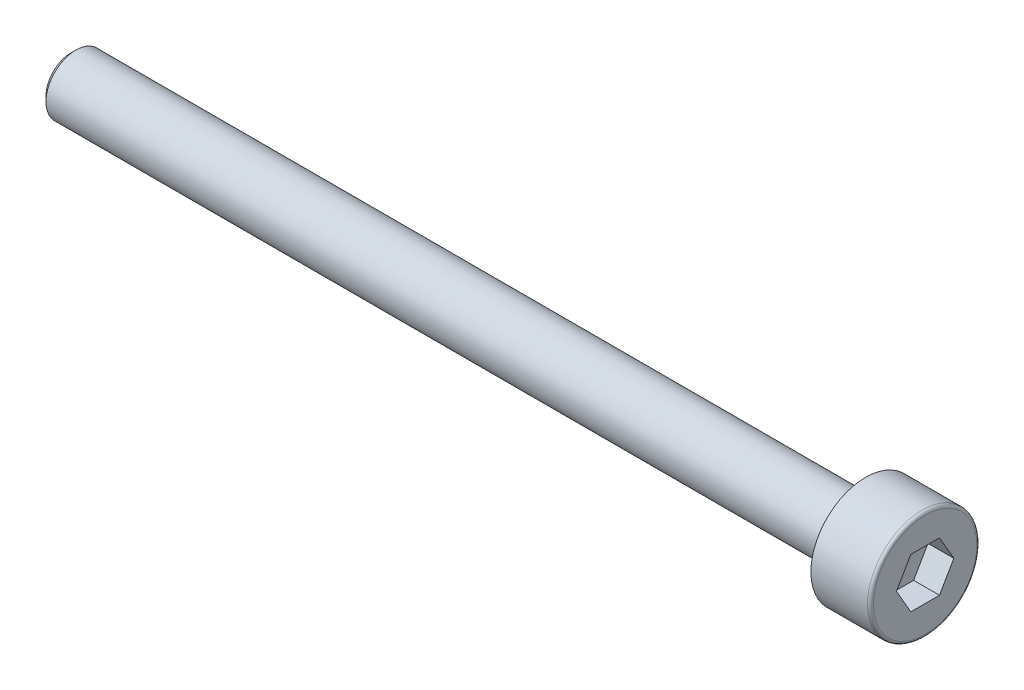
ISO-10303-21;
HEADER;
FILE_DESCRIPTION(('STEP AP214'),'2;1');
FILE_NAME('part.step','',(''),(''),'','','');
FILE_SCHEMA(('AUTOMOTIVE_DESIGN { 1 0 10303 214 1 1 1 1 }'));
ENDSEC;
DATA;
#1=APPLICATION_CONTEXT('core data for automotive mechanical design processes');
#2=APPLICATION_PROTOCOL_DEFINITION('international standard','automotive_design',2000,#1);
#3=PRODUCT_CONTEXT('',#1,'mechanical');
#4=PRODUCT('Part','Part','',(#3));
#5=PRODUCT_RELATED_PRODUCT_CATEGORY('part','',(#4));
#6=PRODUCT_DEFINITION_FORMATION('','',#4);
#7=PRODUCT_DEFINITION_CONTEXT('part definition',#1,'design');
#8=PRODUCT_DEFINITION('design','',#6,#7);
#9=PRODUCT_DEFINITION_SHAPE('','',#8);
#10=(LENGTH_UNIT() NAMED_UNIT(*) SI_UNIT(.MILLI.,.METRE.));
#11=(NAMED_UNIT(*) PLANE_ANGLE_UNIT() SI_UNIT($,.RADIAN.));
#12=(NAMED_UNIT(*) SI_UNIT($,.STERADIAN.) SOLID_ANGLE_UNIT());
#13=UNCERTAINTY_MEASURE_WITH_UNIT(LENGTH_MEASURE(1.E-05),#10,'distance_accuracy_value','');
#14=(GEOMETRIC_REPRESENTATION_CONTEXT(3) GLOBAL_UNCERTAINTY_ASSIGNED_CONTEXT((#13)) GLOBAL_UNIT_ASSIGNED_CONTEXT((#10,
#11,#12)) REPRESENTATION_CONTEXT('',''));
#15=CARTESIAN_POINT('',(0.,0.,0.));
#16=DIRECTION('',(0.,0.,1.));
#17=DIRECTION('',(1.,0.,0.));
#18=AXIS2_PLACEMENT_3D('',#15,#16,#17);
#19=CARTESIAN_POINT('',(0.,0.,0.));
#20=DIRECTION('',(1.,0.,0.));
#21=DIRECTION('',(0.,1.,0.));
#22=AXIS2_PLACEMENT_3D('',#19,#20,#21);
#23=PLANE('',#22);
#24=DIRECTION('',(0.,-0.866025403784439,0.5));
#25=VECTOR('',#24,1.);
#26=CARTESIAN_POINT('',(0.,1.25,0.721687836487035));
#27=LINE('',#26,#25);
#28=CARTESIAN_POINT('',(0.,1.25,0.721687836487035));
#29=VERTEX_POINT('',#28);
#30=CARTESIAN_POINT('',(0.,0.,1.44337567297407));
#31=VERTEX_POINT('',#30);
#32=EDGE_CURVE('E31',#29,#31,#27,.T.);
#33=ORIENTED_EDGE('',*,*,#32,.F.);
#34=DIRECTION('',(0.,0.,1.));
#35=VECTOR('',#34,1.);
#36=CARTESIAN_POINT('',(0.,1.25,-0.721687836487035));
#37=LINE('',#36,#35);
#38=CARTESIAN_POINT('',(0.,1.25,-0.721687836487035));
#39=VERTEX_POINT('',#38);
#40=EDGE_CURVE('E114',#39,#29,#37,.T.);
#41=ORIENTED_EDGE('',*,*,#40,.F.);
#42=DIRECTION('',(0.,0.866025403784439,0.5));
#43=VECTOR('',#42,1.);
#44=CARTESIAN_POINT('',(0.,0.,-1.44337567297406));
#45=LINE('',#44,#43);
#46=CARTESIAN_POINT('',(0.,0.,-1.44337567297406));
#47=VERTEX_POINT('',#46);
#48=EDGE_CURVE('E112',#47,#39,#45,.T.);
#49=ORIENTED_EDGE('',*,*,#48,.F.);
#50=DIRECTION('',(0.,0.866025403784439,-0.5));
#51=VECTOR('',#50,1.);
#52=CARTESIAN_POINT('',(0.,-1.25,-0.721687836487029));
#53=LINE('',#52,#51);
#54=CARTESIAN_POINT('',(0.,-1.25,-0.721687836487029));
#55=VERTEX_POINT('',#54);
#56=EDGE_CURVE('E79',#55,#47,#53,.T.);
#57=ORIENTED_EDGE('',*,*,#56,.F.);
#58=DIRECTION('',(0.,0.,-1.));
#59=VECTOR('',#58,1.);
#60=CARTESIAN_POINT('',(0.,-1.25,0.721687836487035));
#61=LINE('',#60,#59);
#62=CARTESIAN_POINT('',(0.,-1.25,0.721687836487035));
#63=VERTEX_POINT('',#62);
#64=EDGE_CURVE('E108',#63,#55,#61,.T.);
#65=ORIENTED_EDGE('',*,*,#64,.F.);
#66=DIRECTION('',(0.,-0.866025403784439,-0.5));
#67=VECTOR('',#66,1.);
#68=CARTESIAN_POINT('',(0.,0.,1.44337567297407));
#69=LINE('',#68,#67);
#70=EDGE_CURVE('E105',#31,#63,#69,.T.);
#71=ORIENTED_EDGE('',*,*,#70,.F.);
#72=EDGE_LOOP('',(#33,#41,#49,#57,#65,#71));
#73=FACE_BOUND('',#72,.T.);
#74=CARTESIAN_POINT('',(0.,0.,0.));
#75=DIRECTION('',(1.,0.,0.));
#76=DIRECTION('',(0.,1.,0.));
#77=AXIS2_PLACEMENT_3D('',#74,#75,#76);
#78=CIRCLE('',#77,2.6);
#79=CARTESIAN_POINT('',(0.,2.6,0.));
#80=VERTEX_POINT('',#79);
#81=EDGE_CURVE('E132',#80,#80,#78,.T.);
#82=ORIENTED_EDGE('',*,*,#81,.T.);
#83=EDGE_LOOP('',(#82));
#84=FACE_BOUND('',#83,.T.);
#85=ADVANCED_FACE('F16',(#73,#84),#23,.T.);
#86=CARTESIAN_POINT('',(-0.15,0.,0.));
#87=DIRECTION('',(1.,0.,0.));
#88=DIRECTION('',(0.,1.,0.));
#89=AXIS2_PLACEMENT_3D('',#86,#87,#88);
#90=TOROIDAL_SURFACE('',#89,2.6,0.15);
#91=CARTESIAN_POINT('',(-0.15,0.,0.));
#92=DIRECTION('',(1.,0.,0.));
#93=DIRECTION('',(0.,1.,0.));
#94=AXIS2_PLACEMENT_3D('',#91,#92,#93);
#95=CIRCLE('',#94,2.75);
#96=CARTESIAN_POINT('',(-0.15,2.75,0.));
#97=VERTEX_POINT('',#96);
#98=EDGE_CURVE('E129',#97,#97,#95,.T.);
#99=ORIENTED_EDGE('',*,*,#98,.T.);
#100=EDGE_LOOP('',(#99));
#101=FACE_BOUND('',#100,.T.);
#102=ORIENTED_EDGE('',*,*,#81,.F.);
#103=EDGE_LOOP('',(#102));
#104=FACE_BOUND('',#103,.T.);
#105=ADVANCED_FACE('F151',(#101,#104),#90,.T.);
#106=CARTESIAN_POINT('',(0.,0.,0.));
#107=DIRECTION('',(1.,0.,0.));
#108=DIRECTION('',(0.,1.,0.));
#109=AXIS2_PLACEMENT_3D('',#106,#107,#108);
#110=CYLINDRICAL_SURFACE('',#109,2.75);
#111=CARTESIAN_POINT('',(-3.,0.,0.));
#112=DIRECTION('',(1.,0.,0.));
#113=DIRECTION('',(0.,1.,0.));
#114=AXIS2_PLACEMENT_3D('',#111,#112,#113);
#115=CIRCLE('',#114,2.75);
#116=CARTESIAN_POINT('',(-3.,2.75,0.));
#117=VERTEX_POINT('',#116);
#118=EDGE_CURVE('E126',#117,#117,#115,.T.);
#119=ORIENTED_EDGE('',*,*,#118,.T.);
#120=EDGE_LOOP('',(#119));
#121=FACE_BOUND('',#120,.T.);
#122=ORIENTED_EDGE('',*,*,#98,.F.);
#123=EDGE_LOOP('',(#122));
#124=FACE_BOUND('',#123,.T.);
#125=ADVANCED_FACE('F157',(#121,#124),#110,.T.);
#126=CARTESIAN_POINT('',(-3.,2.75,0.));
#127=DIRECTION('',(-1.,0.,0.));
#128=DIRECTION('',(0.,-1.,0.));
#129=AXIS2_PLACEMENT_3D('',#126,#127,#128);
#130=PLANE('',#129);
#131=CARTESIAN_POINT('',(-3.,0.,0.));
#132=DIRECTION('',(1.,0.,0.));
#133=DIRECTION('',(0.,1.,0.));
#134=AXIS2_PLACEMENT_3D('',#131,#132,#133);
#135=CIRCLE('',#134,1.5);
#136=CARTESIAN_POINT('',(-3.,1.5,0.));
#137=VERTEX_POINT('',#136);
#138=EDGE_CURVE('E118',#137,#137,#135,.T.);
#139=ORIENTED_EDGE('',*,*,#138,.T.);
#140=EDGE_LOOP('',(#139));
#141=FACE_BOUND('',#140,.T.);
#142=ORIENTED_EDGE('',*,*,#118,.F.);
#143=EDGE_LOOP('',(#142));
#144=FACE_BOUND('',#143,.T.);
#145=ADVANCED_FACE('F164',(#141,#144),#130,.T.);
#146=CARTESIAN_POINT('',(0.,0.,0.));
#147=DIRECTION('',(1.,0.,0.));
#148=DIRECTION('',(0.,1.,0.));
#149=AXIS2_PLACEMENT_3D('',#146,#147,#148);
#150=CYLINDRICAL_SURFACE('',#149,1.5);
#151=CARTESIAN_POINT('',(-42.75,0.,0.));
#152=DIRECTION('',(-1.,0.,0.));
#153=DIRECTION('',(0.,-1.,0.));
#154=AXIS2_PLACEMENT_3D('',#151,#152,#153);
#155=CIRCLE('',#154,1.5);
#156=CARTESIAN_POINT('',(-42.75,-1.50000000000001,0.));
#157=VERTEX_POINT('',#156);
#158=EDGE_CURVE('E24',#157,#157,#155,.F.);
#159=ORIENTED_EDGE('',*,*,#158,.T.);
#160=EDGE_LOOP('',(#159));
#161=FACE_BOUND('',#160,.T.);
#162=ORIENTED_EDGE('',*,*,#138,.F.);
#163=EDGE_LOOP('',(#162));
#164=FACE_BOUND('',#163,.T.);
#165=ADVANCED_FACE('F137',(#161,#164),#150,.T.);
#166=CARTESIAN_POINT('',(-43.,1.5,0.));
#167=DIRECTION('',(-1.,0.,0.));
#168=DIRECTION('',(0.,-1.,0.));
#169=AXIS2_PLACEMENT_3D('',#166,#167,#168);
#170=PLANE('',#169);
#171=CARTESIAN_POINT('',(-43.,0.,0.));
#172=DIRECTION('',(-1.,0.,0.));
#173=DIRECTION('',(0.,-1.,0.));
#174=AXIS2_PLACEMENT_3D('',#171,#172,#173);
#175=CIRCLE('',#174,1.25000000000002);
#176=CARTESIAN_POINT('',(-43.,-1.25000000000003,0.));
#177=VERTEX_POINT('',#176);
#178=EDGE_CURVE('E11',#177,#177,#175,.T.);
#179=ORIENTED_EDGE('',*,*,#178,.T.);
#180=EDGE_LOOP('',(#179));
#181=FACE_BOUND('',#180,.T.);
#182=ADVANCED_FACE('F171',(#181),#170,.T.);
#183=CARTESIAN_POINT('',(-1.3,1.25,0.721687836487035));
#184=DIRECTION('',(0.,0.5,0.866025403784439));
#185=DIRECTION('',(0.,-0.866025403784439,0.5));
#186=AXIS2_PLACEMENT_3D('',#183,#184,#185);
#187=PLANE('',#186);
#188=ORIENTED_EDGE('',*,*,#32,.T.);
#189=DIRECTION('',(1.,0.,0.));
#190=VECTOR('',#189,1.);
#191=CARTESIAN_POINT('',(-1.3,0.,1.44337567297407));
#192=LINE('',#191,#190);
#193=CARTESIAN_POINT('',(-1.3,0.,1.44337567297407));
#194=VERTEX_POINT('',#193);
#195=EDGE_CURVE('E61',#194,#31,#192,.T.);
#196=ORIENTED_EDGE('',*,*,#195,.F.);
#197=DIRECTION('',(0.,-0.866025403784439,0.5));
#198=VECTOR('',#197,1.);
#199=CARTESIAN_POINT('',(-1.3,1.25,0.721687836487035));
#200=LINE('',#199,#198);
#201=CARTESIAN_POINT('',(-1.3,1.25,0.721687836487035));
#202=VERTEX_POINT('',#201);
#203=EDGE_CURVE('E116',#202,#194,#200,.T.);
#204=ORIENTED_EDGE('',*,*,#203,.F.);
#205=DIRECTION('',(1.,0.,0.));
#206=VECTOR('',#205,1.);
#207=CARTESIAN_POINT('',(-1.3,1.25,0.721687836487035));
#208=LINE('',#207,#206);
#209=EDGE_CURVE('E39',#202,#29,#208,.T.);
#210=ORIENTED_EDGE('',*,*,#209,.T.);
#211=EDGE_LOOP('',(#188,#196,#204,#210));
#212=FACE_BOUND('',#211,.T.);
#213=ADVANCED_FACE('F174',(#212),#187,.F.);
#214=CARTESIAN_POINT('',(-1.3,1.25,-0.721687836487035));
#215=DIRECTION('',(0.,1.,0.));
#216=DIRECTION('',(-1.,0.,0.));
#217=AXIS2_PLACEMENT_3D('',#214,#215,#216);
#218=PLANE('',#217);
#219=ORIENTED_EDGE('',*,*,#40,.T.);
#220=ORIENTED_EDGE('',*,*,#209,.F.);
#221=DIRECTION('',(0.,0.,1.));
#222=VECTOR('',#221,1.);
#223=CARTESIAN_POINT('',(-1.3,1.25,-0.721687836487035));
#224=LINE('',#223,#222);
#225=CARTESIAN_POINT('',(-1.3,1.25,-0.721687836487035));
#226=VERTEX_POINT('',#225);
#227=EDGE_CURVE('E91',#226,#202,#224,.T.);
#228=ORIENTED_EDGE('',*,*,#227,.F.);
#229=DIRECTION('',(1.,0.,0.));
#230=VECTOR('',#229,1.);
#231=CARTESIAN_POINT('',(-1.3,1.25,-0.721687836487035));
#232=LINE('',#231,#230);
#233=EDGE_CURVE('E83',#226,#39,#232,.T.);
#234=ORIENTED_EDGE('',*,*,#233,.T.);
#235=EDGE_LOOP('',(#219,#220,#228,#234));
#236=FACE_BOUND('',#235,.T.);
#237=ADVANCED_FACE('F178',(#236),#218,.F.);
#238=CARTESIAN_POINT('',(-1.3,0.,-1.44337567297406));
#239=DIRECTION('',(0.,0.5,-0.866025403784439));
#240=DIRECTION('',(0.,0.866025403784439,0.5));
#241=AXIS2_PLACEMENT_3D('',#238,#239,#240);
#242=PLANE('',#241);
#243=ORIENTED_EDGE('',*,*,#48,.T.);
#244=ORIENTED_EDGE('',*,*,#233,.F.);
#245=DIRECTION('',(0.,0.866025403784439,0.5));
#246=VECTOR('',#245,1.);
#247=CARTESIAN_POINT('',(-1.3,0.,-1.44337567297406));
#248=LINE('',#247,#246);
#249=CARTESIAN_POINT('',(-1.3,0.,-1.44337567297406));
#250=VERTEX_POINT('',#249);
#251=EDGE_CURVE('E87',#250,#226,#248,.T.);
#252=ORIENTED_EDGE('',*,*,#251,.F.);
#253=DIRECTION('',(1.,0.,0.));
#254=VECTOR('',#253,1.);
#255=CARTESIAN_POINT('',(-1.3,0.,-1.44337567297406));
#256=LINE('',#255,#254);
#257=EDGE_CURVE('E72',#250,#47,#256,.T.);
#258=ORIENTED_EDGE('',*,*,#257,.T.);
#259=EDGE_LOOP('',(#243,#244,#252,#258));
#260=FACE_BOUND('',#259,.T.);
#261=ADVANCED_FACE('F88',(#260),#242,.F.);
#262=CARTESIAN_POINT('',(-1.3,-1.25,-0.721687836487029));
#263=DIRECTION('',(0.,-0.5,-0.866025403784439));
#264=DIRECTION('',(0.,0.866025403784439,-0.5));
#265=AXIS2_PLACEMENT_3D('',#262,#263,#264);
#266=PLANE('',#265);
#267=ORIENTED_EDGE('',*,*,#56,.T.);
#268=ORIENTED_EDGE('',*,*,#257,.F.);
#269=DIRECTION('',(0.,0.866025403784439,-0.5));
#270=VECTOR('',#269,1.);
#271=CARTESIAN_POINT('',(-1.3,-1.25,-0.721687836487029));
#272=LINE('',#271,#270);
#273=CARTESIAN_POINT('',(-1.3,-1.25,-0.721687836487029));
#274=VERTEX_POINT('',#273);
#275=EDGE_CURVE('E76',#274,#250,#272,.T.);
#276=ORIENTED_EDGE('',*,*,#275,.F.);
#277=DIRECTION('',(1.,0.,0.));
#278=VECTOR('',#277,1.);
#279=CARTESIAN_POINT('',(-1.3,-1.25,-0.721687836487029));
#280=LINE('',#279,#278);
#281=EDGE_CURVE('E84',#274,#55,#280,.T.);
#282=ORIENTED_EDGE('',*,*,#281,.T.);
#283=EDGE_LOOP('',(#267,#268,#276,#282));
#284=FACE_BOUND('',#283,.T.);
#285=ADVANCED_FACE('F74',(#284),#266,.F.);
#286=CARTESIAN_POINT('',(-1.3,-1.25,0.721687836487035));
#287=DIRECTION('',(0.,-1.,0.));
#288=DIRECTION('',(0.,0.,-1.));
#289=AXIS2_PLACEMENT_3D('',#286,#287,#288);
#290=PLANE('',#289);
#291=ORIENTED_EDGE('',*,*,#64,.T.);
#292=ORIENTED_EDGE('',*,*,#281,.F.);
#293=DIRECTION('',(0.,0.,-1.));
#294=VECTOR('',#293,1.);
#295=CARTESIAN_POINT('',(-1.3,-1.25,0.721687836487035));
#296=LINE('',#295,#294);
#297=CARTESIAN_POINT('',(-1.3,-1.25,0.721687836487035));
#298=VERTEX_POINT('',#297);
#299=EDGE_CURVE('E97',#298,#274,#296,.T.);
#300=ORIENTED_EDGE('',*,*,#299,.F.);
#301=DIRECTION('',(1.,0.,0.));
#302=VECTOR('',#301,1.);
#303=CARTESIAN_POINT('',(-1.3,-1.25,0.721687836487035));
#304=LINE('',#303,#302);
#305=EDGE_CURVE('E121',#298,#63,#304,.T.);
#306=ORIENTED_EDGE('',*,*,#305,.T.);
#307=EDGE_LOOP('',(#291,#292,#300,#306));
#308=FACE_BOUND('',#307,.T.);
#309=ADVANCED_FACE('F181',(#308),#290,.F.);
#310=CARTESIAN_POINT('',(-1.3,0.,1.44337567297407));
#311=DIRECTION('',(0.,-0.5,0.866025403784439));
#312=DIRECTION('',(0.,-0.866025403784439,-0.5));
#313=AXIS2_PLACEMENT_3D('',#310,#311,#312);
#314=PLANE('',#313);
#315=ORIENTED_EDGE('',*,*,#70,.T.);
#316=ORIENTED_EDGE('',*,*,#305,.F.);
#317=DIRECTION('',(0.,-0.866025403784439,-0.5));
#318=VECTOR('',#317,1.);
#319=CARTESIAN_POINT('',(-1.3,0.,1.44337567297407));
#320=LINE('',#319,#318);
#321=EDGE_CURVE('E99',#194,#298,#320,.T.);
#322=ORIENTED_EDGE('',*,*,#321,.F.);
#323=ORIENTED_EDGE('',*,*,#195,.T.);
#324=EDGE_LOOP('',(#315,#316,#322,#323));
#325=FACE_BOUND('',#324,.T.);
#326=ADVANCED_FACE('F147',(#325),#314,.F.);
#327=CARTESIAN_POINT('',(-1.3,0.,1.44337567297407));
#328=DIRECTION('',(1.,0.,0.));
#329=DIRECTION('',(0.,1.,0.));
#330=AXIS2_PLACEMENT_3D('',#327,#328,#329);
#331=PLANE('',#330);
#332=ORIENTED_EDGE('',*,*,#203,.T.);
#333=ORIENTED_EDGE('',*,*,#321,.T.);
#334=ORIENTED_EDGE('',*,*,#299,.T.);
#335=ORIENTED_EDGE('',*,*,#275,.T.);
#336=ORIENTED_EDGE('',*,*,#251,.T.);
#337=ORIENTED_EDGE('',*,*,#227,.T.);
#338=EDGE_LOOP('',(#332,#333,#334,#335,#336,#337));
#339=FACE_BOUND('',#338,.T.);
#340=ADVANCED_FACE('F94',(#339),#331,.T.);
#341=CARTESIAN_POINT('',(-42.75,0.,0.));
#342=DIRECTION('',(1.,0.,0.));
#343=DIRECTION('',(0.,1.,0.));
#344=AXIS2_PLACEMENT_3D('',#341,#342,#343);
#345=CONICAL_SURFACE('',#344,1.5,0.785398163397452);
#346=ORIENTED_EDGE('',*,*,#178,.F.);
#347=EDGE_LOOP('',(#346));
#348=FACE_BOUND('',#347,.T.);
#349=ORIENTED_EDGE('',*,*,#158,.F.);
#350=EDGE_LOOP('',(#349));
#351=FACE_BOUND('',#350,.T.);
#352=ADVANCED_FACE('F18',(#348,#351),#345,.T.);
#353=CLOSED_SHELL('',(#85,#105,#125,#145,#165,#182,#213,#237,#261,#285,#309,#326,#340,#352));
#354=MANIFOLD_SOLID_BREP('B1',#353);
#355=ADVANCED_BREP_SHAPE_REPRESENTATION('',(#18,#354),#14);
#356=SHAPE_DEFINITION_REPRESENTATION(#9,#355);
ENDSEC;
END-ISO-10303-21;
